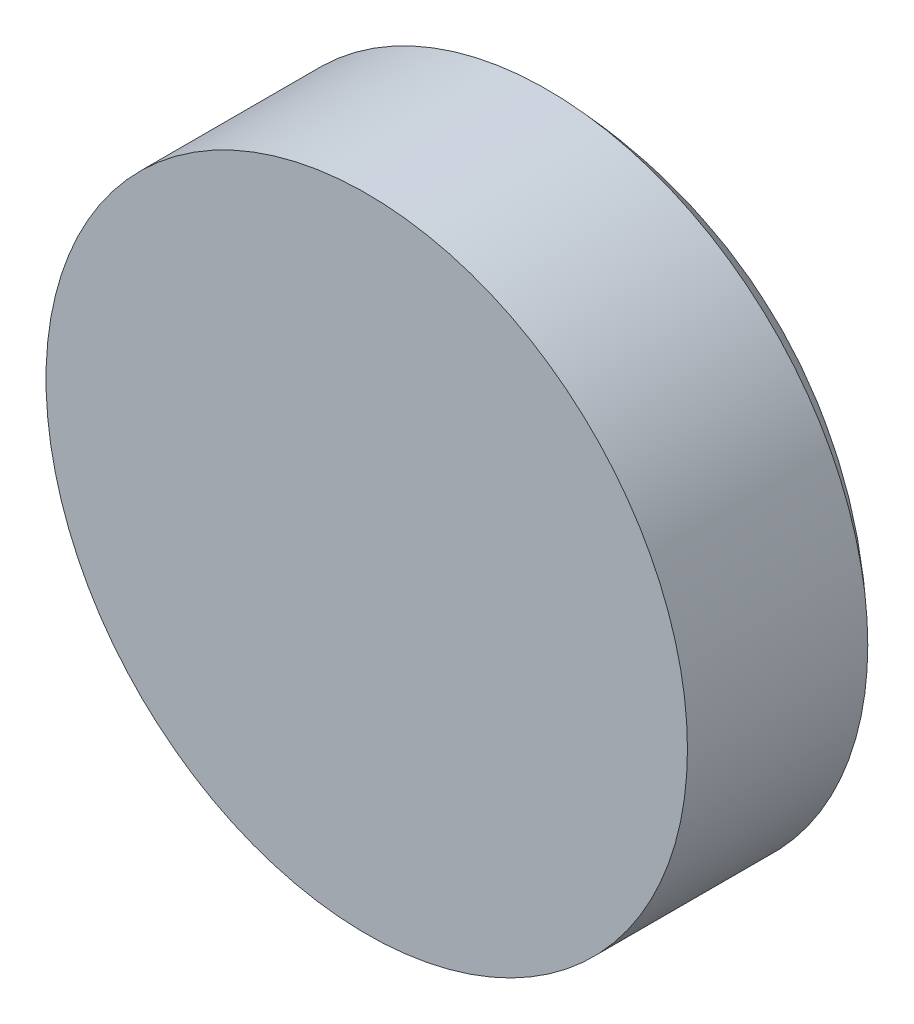
ISO-10303-21;
HEADER;
FILE_DESCRIPTION(('STEP AP214'),'2;1');
FILE_NAME('part.step','',(''),(''),'','','');
FILE_SCHEMA(('AUTOMOTIVE_DESIGN { 1 0 10303 214 1 1 1 1 }'));
ENDSEC;
DATA;
#1=APPLICATION_CONTEXT('core data for automotive mechanical design processes');
#2=APPLICATION_PROTOCOL_DEFINITION('international standard','automotive_design',2000,#1);
#3=PRODUCT_CONTEXT('',#1,'mechanical');
#4=PRODUCT('Part','Part','',(#3));
#5=PRODUCT_RELATED_PRODUCT_CATEGORY('part','',(#4));
#6=PRODUCT_DEFINITION_FORMATION('','',#4);
#7=PRODUCT_DEFINITION_CONTEXT('part definition',#1,'design');
#8=PRODUCT_DEFINITION('design','',#6,#7);
#9=PRODUCT_DEFINITION_SHAPE('','',#8);
#10=(LENGTH_UNIT() NAMED_UNIT(*) SI_UNIT(.MILLI.,.METRE.));
#11=(NAMED_UNIT(*) PLANE_ANGLE_UNIT() SI_UNIT($,.RADIAN.));
#12=(NAMED_UNIT(*) SI_UNIT($,.STERADIAN.) SOLID_ANGLE_UNIT());
#13=UNCERTAINTY_MEASURE_WITH_UNIT(LENGTH_MEASURE(1.E-05),#10,'distance_accuracy_value','');
#14=(GEOMETRIC_REPRESENTATION_CONTEXT(3) GLOBAL_UNCERTAINTY_ASSIGNED_CONTEXT((#13)) GLOBAL_UNIT_ASSIGNED_CONTEXT((#10,
#11,#12)) REPRESENTATION_CONTEXT('',''));
#15=CARTESIAN_POINT('',(0.,0.,0.));
#16=DIRECTION('',(0.,0.,1.));
#17=DIRECTION('',(1.,0.,0.));
#18=AXIS2_PLACEMENT_3D('',#15,#16,#17);
#19=CARTESIAN_POINT('',(0.,6.579,4.));
#20=DIRECTION('',(0.,0.,1.));
#21=DIRECTION('',(1.,0.,0.));
#22=AXIS2_PLACEMENT_3D('',#19,#20,#21);
#23=PLANE('',#22);
#24=CARTESIAN_POINT('',(0.,0.,4.));
#25=DIRECTION('',(0.,0.,1.));
#26=DIRECTION('',(1.,0.,0.));
#27=AXIS2_PLACEMENT_3D('',#24,#25,#26);
#28=CIRCLE('',#27,3.125);
#29=CARTESIAN_POINT('',(3.125,0.,4.));
#30=VERTEX_POINT('',#29);
#31=EDGE_CURVE('E17',#30,#30,#28,.F.);
#32=ORIENTED_EDGE('',*,*,#31,.F.);
#33=EDGE_LOOP('',(#32));
#34=FACE_BOUND('',#33,.T.);
#35=ADVANCED_FACE('F14',(#34),#23,.T.);
#36=CARTESIAN_POINT('',(0.,0.,2.24290535363743));
#37=DIRECTION('',(0.,0.,1.));
#38=DIRECTION('',(1.,0.,0.));
#39=AXIS2_PLACEMENT_3D('',#36,#37,#38);
#40=CYLINDRICAL_SURFACE('',#39,3.125);
#41=CARTESIAN_POINT('',(0.,0.,2.24290535363743));
#42=DIRECTION('',(0.,0.,1.));
#43=DIRECTION('',(1.,0.,0.));
#44=AXIS2_PLACEMENT_3D('',#41,#42,#43);
#45=CIRCLE('',#44,3.125);
#46=CARTESIAN_POINT('',(3.125,0.,2.24290535363743));
#47=VERTEX_POINT('',#46);
#48=EDGE_CURVE('E10',#47,#47,#45,.F.);
#49=ORIENTED_EDGE('',*,*,#48,.F.);
#50=EDGE_LOOP('',(#49));
#51=FACE_BOUND('',#50,.T.);
#52=ORIENTED_EDGE('',*,*,#31,.T.);
#53=EDGE_LOOP('',(#52));
#54=FACE_BOUND('',#53,.T.);
#55=ADVANCED_FACE('F29',(#51,#54),#40,.T.);
#56=CARTESIAN_POINT('',(0.,0.,5.55));
#57=DIRECTION('',(0.,-1.,0.));
#58=DIRECTION('',(0.,0.,-1.));
#59=AXIS2_PLACEMENT_3D('',#56,#57,#58);
#60=SPHERICAL_SURFACE('',#59,4.55);
#61=ORIENTED_EDGE('',*,*,#48,.T.);
#62=EDGE_LOOP('',(#61));
#63=FACE_BOUND('',#62,.T.);
#64=ADVANCED_FACE('F27',(#63),#60,.T.);
#65=CLOSED_SHELL('',(#35,#55,#64));
#66=MANIFOLD_SOLID_BREP('B1',#65);
#67=ADVANCED_BREP_SHAPE_REPRESENTATION('',(#18,#66),#14);
#68=SHAPE_DEFINITION_REPRESENTATION(#9,#67);
ENDSEC;
END-ISO-10303-21;
